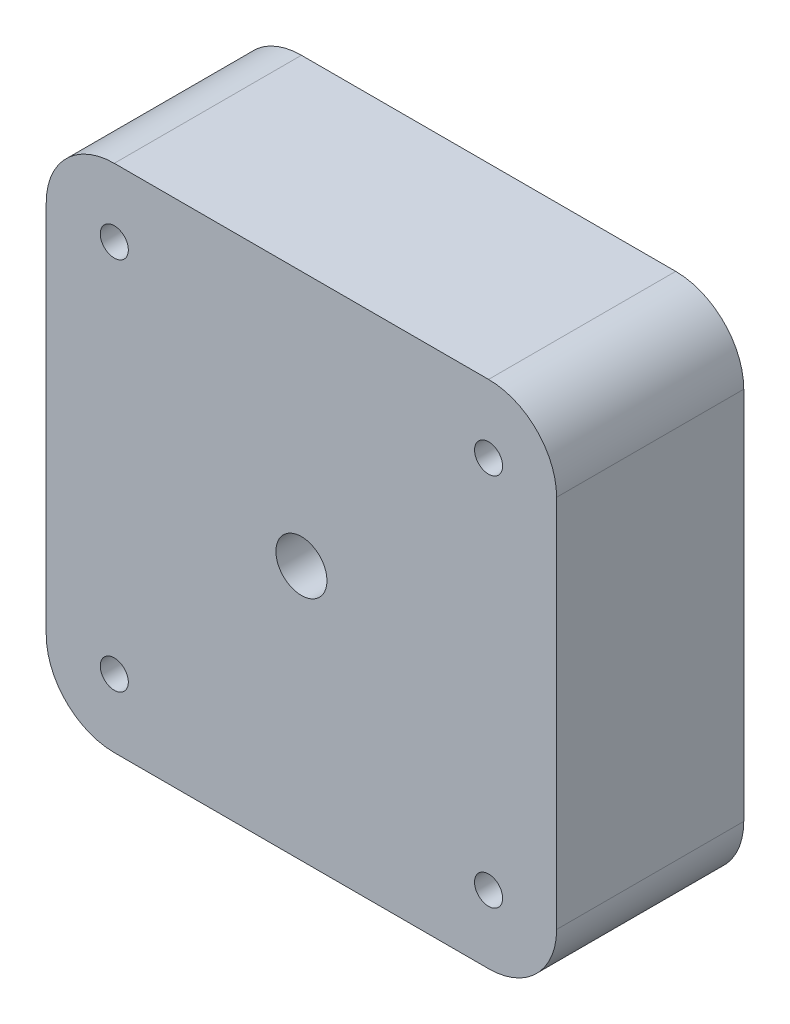
ISO-10303-21;
HEADER;
FILE_DESCRIPTION(('STEP AP214'),'2;1');
FILE_NAME('part.step','',(''),(''),'','','');
FILE_SCHEMA(('AUTOMOTIVE_DESIGN { 1 0 10303 214 1 1 1 1 }'));
ENDSEC;
DATA;
#1=APPLICATION_CONTEXT('core data for automotive mechanical design processes');
#2=APPLICATION_PROTOCOL_DEFINITION('international standard','automotive_design',2000,#1);
#3=PRODUCT_CONTEXT('',#1,'mechanical');
#4=PRODUCT('Part','Part','',(#3));
#5=PRODUCT_RELATED_PRODUCT_CATEGORY('part','',(#4));
#6=PRODUCT_DEFINITION_FORMATION('','',#4);
#7=PRODUCT_DEFINITION_CONTEXT('part definition',#1,'design');
#8=PRODUCT_DEFINITION('design','',#6,#7);
#9=PRODUCT_DEFINITION_SHAPE('','',#8);
#10=(LENGTH_UNIT() NAMED_UNIT(*) SI_UNIT(.MILLI.,.METRE.));
#11=(NAMED_UNIT(*) PLANE_ANGLE_UNIT() SI_UNIT($,.RADIAN.));
#12=(NAMED_UNIT(*) SI_UNIT($,.STERADIAN.) SOLID_ANGLE_UNIT());
#13=UNCERTAINTY_MEASURE_WITH_UNIT(LENGTH_MEASURE(1.E-05),#10,'distance_accuracy_value','');
#14=(GEOMETRIC_REPRESENTATION_CONTEXT(3) GLOBAL_UNCERTAINTY_ASSIGNED_CONTEXT((#13)) GLOBAL_UNIT_ASSIGNED_CONTEXT((#10,
#11,#12)) REPRESENTATION_CONTEXT('',''));
#15=CARTESIAN_POINT('',(0.,0.,0.));
#16=DIRECTION('',(0.,0.,1.));
#17=DIRECTION('',(1.,0.,0.));
#18=AXIS2_PLACEMENT_3D('',#15,#16,#17);
#19=CARTESIAN_POINT('',(30.,30.,22.));
#20=DIRECTION('',(-1.,0.,0.));
#21=DIRECTION('',(0.,0.,1.));
#22=AXIS2_PLACEMENT_3D('',#19,#20,#21);
#23=PLANE('',#22);
#24=DIRECTION('',(0.,1.,0.));
#25=VECTOR('',#24,1.);
#26=CARTESIAN_POINT('',(30.,30.,22.));
#27=LINE('',#26,#25);
#28=CARTESIAN_POINT('',(30.,-22.,22.));
#29=VERTEX_POINT('',#28);
#30=CARTESIAN_POINT('',(30.,22.,22.));
#31=VERTEX_POINT('',#30);
#32=EDGE_CURVE('E120',#29,#31,#27,.T.);
#33=ORIENTED_EDGE('',*,*,#32,.F.);
#34=DIRECTION('',(0.,0.,-1.));
#35=VECTOR('',#34,1.);
#36=CARTESIAN_POINT('',(30.,-22.,22.));
#37=LINE('',#36,#35);
#38=CARTESIAN_POINT('',(30.,-22.,0.));
#39=VERTEX_POINT('',#38);
#40=EDGE_CURVE('E105',#29,#39,#37,.T.);
#41=ORIENTED_EDGE('',*,*,#40,.T.);
#42=DIRECTION('',(0.,1.,0.));
#43=VECTOR('',#42,1.);
#44=CARTESIAN_POINT('',(30.,30.,0.));
#45=LINE('',#44,#43);
#46=CARTESIAN_POINT('',(30.,22.,0.));
#47=VERTEX_POINT('',#46);
#48=EDGE_CURVE('E117',#39,#47,#45,.T.);
#49=ORIENTED_EDGE('',*,*,#48,.T.);
#50=DIRECTION('',(0.,0.,-1.));
#51=VECTOR('',#50,1.);
#52=CARTESIAN_POINT('',(30.,22.,22.));
#53=LINE('',#52,#51);
#54=EDGE_CURVE('E122',#47,#31,#53,.F.);
#55=ORIENTED_EDGE('',*,*,#54,.T.);
#56=EDGE_LOOP('',(#33,#41,#49,#55));
#57=FACE_BOUND('',#56,.T.);
#58=ADVANCED_FACE('F34',(#57),#23,.F.);
#59=CARTESIAN_POINT('',(-30.,30.,22.));
#60=DIRECTION('',(0.,-1.,0.));
#61=DIRECTION('',(0.,0.,-1.));
#62=AXIS2_PLACEMENT_3D('',#59,#60,#61);
#63=PLANE('',#62);
#64=DIRECTION('',(-1.,0.,0.));
#65=VECTOR('',#64,1.);
#66=CARTESIAN_POINT('',(-30.,30.,22.));
#67=LINE('',#66,#65);
#68=CARTESIAN_POINT('',(22.,30.,22.));
#69=VERTEX_POINT('',#68);
#70=CARTESIAN_POINT('',(-22.,30.,22.));
#71=VERTEX_POINT('',#70);
#72=EDGE_CURVE('E170',#69,#71,#67,.T.);
#73=ORIENTED_EDGE('',*,*,#72,.F.);
#74=DIRECTION('',(0.,0.,-1.));
#75=VECTOR('',#74,1.);
#76=CARTESIAN_POINT('',(22.,30.,22.));
#77=LINE('',#76,#75);
#78=CARTESIAN_POINT('',(22.,30.,0.));
#79=VERTEX_POINT('',#78);
#80=EDGE_CURVE('E11',#69,#79,#77,.T.);
#81=ORIENTED_EDGE('',*,*,#80,.T.);
#82=DIRECTION('',(-1.,0.,0.));
#83=VECTOR('',#82,1.);
#84=CARTESIAN_POINT('',(-30.,30.,0.));
#85=LINE('',#84,#83);
#86=CARTESIAN_POINT('',(-22.,30.,0.));
#87=VERTEX_POINT('',#86);
#88=EDGE_CURVE('E127',#79,#87,#85,.T.);
#89=ORIENTED_EDGE('',*,*,#88,.T.);
#90=DIRECTION('',(0.,0.,-1.));
#91=VECTOR('',#90,1.);
#92=CARTESIAN_POINT('',(-22.,30.,22.));
#93=LINE('',#92,#91);
#94=EDGE_CURVE('E42',#87,#71,#93,.F.);
#95=ORIENTED_EDGE('',*,*,#94,.T.);
#96=EDGE_LOOP('',(#73,#81,#89,#95));
#97=FACE_BOUND('',#96,.T.);
#98=ADVANCED_FACE('F169',(#97),#63,.F.);
#99=CARTESIAN_POINT('',(-30.,30.,22.));
#100=DIRECTION('',(1.,0.,0.));
#101=DIRECTION('',(0.,0.,-1.));
#102=AXIS2_PLACEMENT_3D('',#99,#100,#101);
#103=PLANE('',#102);
#104=DIRECTION('',(0.,-1.,0.));
#105=VECTOR('',#104,1.);
#106=CARTESIAN_POINT('',(-30.,30.,0.));
#107=LINE('',#106,#105);
#108=CARTESIAN_POINT('',(-30.,22.,0.));
#109=VERTEX_POINT('',#108);
#110=CARTESIAN_POINT('',(-30.,-22.,0.));
#111=VERTEX_POINT('',#110);
#112=EDGE_CURVE('E131',#109,#111,#107,.T.);
#113=ORIENTED_EDGE('',*,*,#112,.T.);
#114=DIRECTION('',(0.,0.,-1.));
#115=VECTOR('',#114,1.);
#116=CARTESIAN_POINT('',(-30.,-22.,22.));
#117=LINE('',#116,#115);
#118=CARTESIAN_POINT('',(-30.,-22.,22.));
#119=VERTEX_POINT('',#118);
#120=EDGE_CURVE('E49',#111,#119,#117,.F.);
#121=ORIENTED_EDGE('',*,*,#120,.T.);
#122=DIRECTION('',(0.,-1.,0.));
#123=VECTOR('',#122,1.);
#124=CARTESIAN_POINT('',(-30.,30.,22.));
#125=LINE('',#124,#123);
#126=CARTESIAN_POINT('',(-30.,22.,22.));
#127=VERTEX_POINT('',#126);
#128=EDGE_CURVE('E176',#127,#119,#125,.T.);
#129=ORIENTED_EDGE('',*,*,#128,.F.);
#130=DIRECTION('',(0.,0.,-1.));
#131=VECTOR('',#130,1.);
#132=CARTESIAN_POINT('',(-30.,22.,22.));
#133=LINE('',#132,#131);
#134=EDGE_CURVE('E163',#127,#109,#133,.T.);
#135=ORIENTED_EDGE('',*,*,#134,.T.);
#136=EDGE_LOOP('',(#113,#121,#129,#135));
#137=FACE_BOUND('',#136,.T.);
#138=ADVANCED_FACE('F180',(#137),#103,.F.);
#139=CARTESIAN_POINT('',(-30.,-30.,22.));
#140=DIRECTION('',(0.,1.,0.));
#141=DIRECTION('',(0.,0.,1.));
#142=AXIS2_PLACEMENT_3D('',#139,#140,#141);
#143=PLANE('',#142);
#144=DIRECTION('',(1.,0.,0.));
#145=VECTOR('',#144,1.);
#146=CARTESIAN_POINT('',(-30.,-30.,0.));
#147=LINE('',#146,#145);
#148=CARTESIAN_POINT('',(-22.,-30.,0.));
#149=VERTEX_POINT('',#148);
#150=CARTESIAN_POINT('',(22.,-30.,0.));
#151=VERTEX_POINT('',#150);
#152=EDGE_CURVE('E141',#149,#151,#147,.T.);
#153=ORIENTED_EDGE('',*,*,#152,.T.);
#154=DIRECTION('',(0.,0.,-1.));
#155=VECTOR('',#154,1.);
#156=CARTESIAN_POINT('',(22.,-30.,22.));
#157=LINE('',#156,#155);
#158=CARTESIAN_POINT('',(22.,-30.,22.));
#159=VERTEX_POINT('',#158);
#160=EDGE_CURVE('E106',#151,#159,#157,.F.);
#161=ORIENTED_EDGE('',*,*,#160,.T.);
#162=DIRECTION('',(1.,0.,0.));
#163=VECTOR('',#162,1.);
#164=CARTESIAN_POINT('',(-30.,-30.,22.));
#165=LINE('',#164,#163);
#166=CARTESIAN_POINT('',(-22.,-30.,22.));
#167=VERTEX_POINT('',#166);
#168=EDGE_CURVE('E137',#167,#159,#165,.T.);
#169=ORIENTED_EDGE('',*,*,#168,.F.);
#170=DIRECTION('',(0.,0.,-1.));
#171=VECTOR('',#170,1.);
#172=CARTESIAN_POINT('',(-22.,-30.,22.));
#173=LINE('',#172,#171);
#174=EDGE_CURVE('E111',#167,#149,#173,.T.);
#175=ORIENTED_EDGE('',*,*,#174,.T.);
#176=EDGE_LOOP('',(#153,#161,#169,#175));
#177=FACE_BOUND('',#176,.T.);
#178=ADVANCED_FACE('F187',(#177),#143,.F.);
#179=CARTESIAN_POINT('',(0.,0.,22.));
#180=DIRECTION('',(0.,0.,1.));
#181=DIRECTION('',(1.,0.,0.));
#182=AXIS2_PLACEMENT_3D('',#179,#180,#181);
#183=PLANE('',#182);
#184=CARTESIAN_POINT('',(22.,22.,22.));
#185=DIRECTION('',(0.,0.,-1.));
#186=DIRECTION('',(-1.,0.,0.));
#187=AXIS2_PLACEMENT_3D('',#184,#185,#186);
#188=CIRCLE('',#187,1.65);
#189=CARTESIAN_POINT('',(20.35,22.,22.));
#190=VERTEX_POINT('',#189);
#191=EDGE_CURVE('E207',#190,#190,#188,.T.);
#192=ORIENTED_EDGE('',*,*,#191,.T.);
#193=EDGE_LOOP('',(#192));
#194=FACE_BOUND('',#193,.T.);
#195=CARTESIAN_POINT('',(-22.,22.,22.));
#196=DIRECTION('',(0.,0.,-1.));
#197=DIRECTION('',(-1.,0.,0.));
#198=AXIS2_PLACEMENT_3D('',#195,#196,#197);
#199=CIRCLE('',#198,1.65);
#200=CARTESIAN_POINT('',(-23.65,22.,22.));
#201=VERTEX_POINT('',#200);
#202=EDGE_CURVE('E201',#201,#201,#199,.T.);
#203=ORIENTED_EDGE('',*,*,#202,.T.);
#204=EDGE_LOOP('',(#203));
#205=FACE_BOUND('',#204,.T.);
#206=CARTESIAN_POINT('',(-22.,-22.,22.));
#207=DIRECTION('',(0.,0.,-1.));
#208=DIRECTION('',(-1.,0.,0.));
#209=AXIS2_PLACEMENT_3D('',#206,#207,#208);
#210=CIRCLE('',#209,1.65);
#211=CARTESIAN_POINT('',(-23.65,-22.,22.));
#212=VERTEX_POINT('',#211);
#213=EDGE_CURVE('E195',#212,#212,#210,.T.);
#214=ORIENTED_EDGE('',*,*,#213,.T.);
#215=EDGE_LOOP('',(#214));
#216=FACE_BOUND('',#215,.T.);
#217=CARTESIAN_POINT('',(22.,-22.,22.));
#218=DIRECTION('',(0.,0.,-1.));
#219=DIRECTION('',(-1.,0.,0.));
#220=AXIS2_PLACEMENT_3D('',#217,#218,#219);
#221=CIRCLE('',#220,1.65);
#222=CARTESIAN_POINT('',(20.35,-22.,22.));
#223=VERTEX_POINT('',#222);
#224=EDGE_CURVE('E134',#223,#223,#221,.T.);
#225=ORIENTED_EDGE('',*,*,#224,.T.);
#226=EDGE_LOOP('',(#225));
#227=FACE_BOUND('',#226,.T.);
#228=CARTESIAN_POINT('',(0.,0.,22.));
#229=DIRECTION('',(0.,0.,-1.));
#230=DIRECTION('',(-1.,0.,0.));
#231=AXIS2_PLACEMENT_3D('',#228,#229,#230);
#232=CIRCLE('',#231,3.);
#233=CARTESIAN_POINT('',(-3.,0.,22.));
#234=VERTEX_POINT('',#233);
#235=EDGE_CURVE('E128',#234,#234,#232,.T.);
#236=ORIENTED_EDGE('',*,*,#235,.T.);
#237=EDGE_LOOP('',(#236));
#238=FACE_BOUND('',#237,.T.);
#239=ORIENTED_EDGE('',*,*,#168,.T.);
#240=CARTESIAN_POINT('',(22.,-22.,22.));
#241=DIRECTION('',(0.,0.,1.));
#242=DIRECTION('',(1.,0.,0.));
#243=AXIS2_PLACEMENT_3D('',#240,#241,#242);
#244=CIRCLE('',#243,8.);
#245=EDGE_CURVE('E161',#159,#29,#244,.T.);
#246=ORIENTED_EDGE('',*,*,#245,.T.);
#247=ORIENTED_EDGE('',*,*,#32,.T.);
#248=CARTESIAN_POINT('',(22.,22.,22.));
#249=DIRECTION('',(0.,0.,1.));
#250=DIRECTION('',(1.,0.,0.));
#251=AXIS2_PLACEMENT_3D('',#248,#249,#250);
#252=CIRCLE('',#251,8.);
#253=EDGE_CURVE('E157',#31,#69,#252,.T.);
#254=ORIENTED_EDGE('',*,*,#253,.T.);
#255=ORIENTED_EDGE('',*,*,#72,.T.);
#256=CARTESIAN_POINT('',(-22.,22.,22.));
#257=DIRECTION('',(0.,0.,1.));
#258=DIRECTION('',(1.,0.,0.));
#259=AXIS2_PLACEMENT_3D('',#256,#257,#258);
#260=CIRCLE('',#259,8.);
#261=EDGE_CURVE('E56',#71,#127,#260,.T.);
#262=ORIENTED_EDGE('',*,*,#261,.T.);
#263=ORIENTED_EDGE('',*,*,#128,.T.);
#264=CARTESIAN_POINT('',(-22.,-22.,22.));
#265=DIRECTION('',(0.,0.,1.));
#266=DIRECTION('',(1.,0.,0.));
#267=AXIS2_PLACEMENT_3D('',#264,#265,#266);
#268=CIRCLE('',#267,8.);
#269=EDGE_CURVE('E159',#119,#167,#268,.T.);
#270=ORIENTED_EDGE('',*,*,#269,.T.);
#271=EDGE_LOOP('',(#239,#246,#247,#254,#255,#262,#263,#270));
#272=FACE_BOUND('',#271,.T.);
#273=ADVANCED_FACE('F174',(#194,#205,#216,#227,#238,#272),#183,.T.);
#274=CARTESIAN_POINT('',(0.,0.,0.));
#275=DIRECTION('',(0.,0.,1.));
#276=DIRECTION('',(1.,0.,0.));
#277=AXIS2_PLACEMENT_3D('',#274,#275,#276);
#278=PLANE('',#277);
#279=CARTESIAN_POINT('',(22.,22.,0.));
#280=DIRECTION('',(0.,0.,-1.));
#281=DIRECTION('',(-1.,0.,0.));
#282=AXIS2_PLACEMENT_3D('',#279,#280,#281);
#283=CIRCLE('',#282,1.64999999999999);
#284=CARTESIAN_POINT('',(20.35,22.,0.));
#285=VERTEX_POINT('',#284);
#286=EDGE_CURVE('E210',#285,#285,#283,.T.);
#287=ORIENTED_EDGE('',*,*,#286,.F.);
#288=EDGE_LOOP('',(#287));
#289=FACE_BOUND('',#288,.T.);
#290=CARTESIAN_POINT('',(-22.,22.,0.));
#291=DIRECTION('',(0.,0.,-1.));
#292=DIRECTION('',(-1.,0.,0.));
#293=AXIS2_PLACEMENT_3D('',#290,#291,#292);
#294=CIRCLE('',#293,1.64999999999999);
#295=CARTESIAN_POINT('',(-23.65,22.,0.));
#296=VERTEX_POINT('',#295);
#297=EDGE_CURVE('E204',#296,#296,#294,.T.);
#298=ORIENTED_EDGE('',*,*,#297,.F.);
#299=EDGE_LOOP('',(#298));
#300=FACE_BOUND('',#299,.T.);
#301=CARTESIAN_POINT('',(-22.,-22.,0.));
#302=DIRECTION('',(0.,0.,-1.));
#303=DIRECTION('',(-1.,0.,0.));
#304=AXIS2_PLACEMENT_3D('',#301,#302,#303);
#305=CIRCLE('',#304,1.64999999999999);
#306=CARTESIAN_POINT('',(-23.65,-22.,0.));
#307=VERTEX_POINT('',#306);
#308=EDGE_CURVE('E198',#307,#307,#305,.T.);
#309=ORIENTED_EDGE('',*,*,#308,.F.);
#310=EDGE_LOOP('',(#309));
#311=FACE_BOUND('',#310,.T.);
#312=CARTESIAN_POINT('',(22.,-22.,0.));
#313=DIRECTION('',(0.,0.,-1.));
#314=DIRECTION('',(-1.,0.,0.));
#315=AXIS2_PLACEMENT_3D('',#312,#313,#314);
#316=CIRCLE('',#315,1.64999999999999);
#317=CARTESIAN_POINT('',(20.35,-22.,0.));
#318=VERTEX_POINT('',#317);
#319=EDGE_CURVE('E192',#318,#318,#316,.T.);
#320=ORIENTED_EDGE('',*,*,#319,.F.);
#321=EDGE_LOOP('',(#320));
#322=FACE_BOUND('',#321,.T.);
#323=CARTESIAN_POINT('',(0.,0.,0.));
#324=DIRECTION('',(0.,0.,1.));
#325=DIRECTION('',(1.,0.,0.));
#326=AXIS2_PLACEMENT_3D('',#323,#324,#325);
#327=CIRCLE('',#326,6.);
#328=CARTESIAN_POINT('',(6.,0.,0.));
#329=VERTEX_POINT('',#328);
#330=EDGE_CURVE('E146',#329,#329,#327,.T.);
#331=ORIENTED_EDGE('',*,*,#330,.T.);
#332=EDGE_LOOP('',(#331));
#333=FACE_BOUND('',#332,.T.);
#334=ORIENTED_EDGE('',*,*,#48,.F.);
#335=CARTESIAN_POINT('',(22.,-22.,0.));
#336=DIRECTION('',(0.,0.,1.));
#337=DIRECTION('',(1.,0.,0.));
#338=AXIS2_PLACEMENT_3D('',#335,#336,#337);
#339=CIRCLE('',#338,8.);
#340=EDGE_CURVE('E101',#39,#151,#339,.F.);
#341=ORIENTED_EDGE('',*,*,#340,.T.);
#342=ORIENTED_EDGE('',*,*,#152,.F.);
#343=CARTESIAN_POINT('',(-22.,-22.,0.));
#344=DIRECTION('',(0.,0.,1.));
#345=DIRECTION('',(1.,0.,0.));
#346=AXIS2_PLACEMENT_3D('',#343,#344,#345);
#347=CIRCLE('',#346,8.);
#348=EDGE_CURVE('E112',#149,#111,#347,.F.);
#349=ORIENTED_EDGE('',*,*,#348,.T.);
#350=ORIENTED_EDGE('',*,*,#112,.F.);
#351=CARTESIAN_POINT('',(-22.,22.,0.));
#352=DIRECTION('',(0.,0.,1.));
#353=DIRECTION('',(1.,0.,0.));
#354=AXIS2_PLACEMENT_3D('',#351,#352,#353);
#355=CIRCLE('',#354,8.);
#356=EDGE_CURVE('E121',#109,#87,#355,.F.);
#357=ORIENTED_EDGE('',*,*,#356,.T.);
#358=ORIENTED_EDGE('',*,*,#88,.F.);
#359=CARTESIAN_POINT('',(22.,22.,0.));
#360=DIRECTION('',(0.,0.,1.));
#361=DIRECTION('',(1.,0.,0.));
#362=AXIS2_PLACEMENT_3D('',#359,#360,#361);
#363=CIRCLE('',#362,8.);
#364=EDGE_CURVE('E126',#79,#47,#363,.F.);
#365=ORIENTED_EDGE('',*,*,#364,.T.);
#366=EDGE_LOOP('',(#334,#341,#342,#349,#350,#357,#358,#365));
#367=FACE_BOUND('',#366,.T.);
#368=ADVANCED_FACE('F124',(#289,#300,#311,#322,#333,#367),#278,.F.);
#369=CARTESIAN_POINT('',(0.,0.,22.));
#370=DIRECTION('',(0.,0.,-1.));
#371=DIRECTION('',(-1.,0.,0.));
#372=AXIS2_PLACEMENT_3D('',#369,#370,#371);
#373=CYLINDRICAL_SURFACE('',#372,3.);
#374=CARTESIAN_POINT('',(0.,0.,2.99999999999998));
#375=DIRECTION('',(0.,0.,1.));
#376=DIRECTION('',(1.,0.,0.));
#377=AXIS2_PLACEMENT_3D('',#374,#375,#376);
#378=CIRCLE('',#377,3.);
#379=CARTESIAN_POINT('',(3.,0.,2.99999999999998));
#380=VERTEX_POINT('',#379);
#381=EDGE_CURVE('E143',#380,#380,#378,.F.);
#382=ORIENTED_EDGE('',*,*,#381,.T.);
#383=EDGE_LOOP('',(#382));
#384=FACE_BOUND('',#383,.T.);
#385=ORIENTED_EDGE('',*,*,#235,.F.);
#386=EDGE_LOOP('',(#385));
#387=FACE_BOUND('',#386,.T.);
#388=ADVANCED_FACE('F218',(#384,#387),#373,.F.);
#389=CARTESIAN_POINT('',(0.,0.,2.99999999999998));
#390=DIRECTION('',(0.,0.,-1.));
#391=DIRECTION('',(-1.,0.,0.));
#392=AXIS2_PLACEMENT_3D('',#389,#390,#391);
#393=CONICAL_SURFACE('',#392,3.,0.785398163397451);
#394=ORIENTED_EDGE('',*,*,#330,.F.);
#395=EDGE_LOOP('',(#394));
#396=FACE_BOUND('',#395,.T.);
#397=ORIENTED_EDGE('',*,*,#381,.F.);
#398=EDGE_LOOP('',(#397));
#399=FACE_BOUND('',#398,.T.);
#400=ADVANCED_FACE('F228',(#396,#399),#393,.F.);
#401=CARTESIAN_POINT('',(22.,-22.,22.));
#402=DIRECTION('',(0.,0.,-1.));
#403=DIRECTION('',(-1.,0.,0.));
#404=AXIS2_PLACEMENT_3D('',#401,#402,#403);
#405=CYLINDRICAL_SURFACE('',#404,8.);
#406=ORIENTED_EDGE('',*,*,#245,.F.);
#407=ORIENTED_EDGE('',*,*,#160,.F.);
#408=ORIENTED_EDGE('',*,*,#340,.F.);
#409=ORIENTED_EDGE('',*,*,#40,.F.);
#410=EDGE_LOOP('',(#406,#407,#408,#409));
#411=FACE_BOUND('',#410,.T.);
#412=ADVANCED_FACE('F104',(#411),#405,.T.);
#413=CARTESIAN_POINT('',(-22.,-22.,22.));
#414=DIRECTION('',(0.,0.,-1.));
#415=DIRECTION('',(-1.,0.,0.));
#416=AXIS2_PLACEMENT_3D('',#413,#414,#415);
#417=CYLINDRICAL_SURFACE('',#416,8.);
#418=ORIENTED_EDGE('',*,*,#269,.F.);
#419=ORIENTED_EDGE('',*,*,#120,.F.);
#420=ORIENTED_EDGE('',*,*,#348,.F.);
#421=ORIENTED_EDGE('',*,*,#174,.F.);
#422=EDGE_LOOP('',(#418,#419,#420,#421));
#423=FACE_BOUND('',#422,.T.);
#424=ADVANCED_FACE('F184',(#423),#417,.T.);
#425=CARTESIAN_POINT('',(22.,22.,22.));
#426=DIRECTION('',(0.,0.,-1.));
#427=DIRECTION('',(-1.,0.,0.));
#428=AXIS2_PLACEMENT_3D('',#425,#426,#427);
#429=CYLINDRICAL_SURFACE('',#428,8.);
#430=ORIENTED_EDGE('',*,*,#253,.F.);
#431=ORIENTED_EDGE('',*,*,#54,.F.);
#432=ORIENTED_EDGE('',*,*,#364,.F.);
#433=ORIENTED_EDGE('',*,*,#80,.F.);
#434=EDGE_LOOP('',(#430,#431,#432,#433));
#435=FACE_BOUND('',#434,.T.);
#436=ADVANCED_FACE('F258',(#435),#429,.T.);
#437=CARTESIAN_POINT('',(-22.,22.,22.));
#438=DIRECTION('',(0.,0.,-1.));
#439=DIRECTION('',(-1.,0.,0.));
#440=AXIS2_PLACEMENT_3D('',#437,#438,#439);
#441=CYLINDRICAL_SURFACE('',#440,8.);
#442=ORIENTED_EDGE('',*,*,#261,.F.);
#443=ORIENTED_EDGE('',*,*,#94,.F.);
#444=ORIENTED_EDGE('',*,*,#356,.F.);
#445=ORIENTED_EDGE('',*,*,#134,.F.);
#446=EDGE_LOOP('',(#442,#443,#444,#445));
#447=FACE_BOUND('',#446,.T.);
#448=ADVANCED_FACE('F36',(#447),#441,.T.);
#449=CARTESIAN_POINT('',(22.,-22.,0.));
#450=DIRECTION('',(0.,0.,-1.));
#451=DIRECTION('',(-1.,0.,0.));
#452=AXIS2_PLACEMENT_3D('',#449,#450,#451);
#453=CYLINDRICAL_SURFACE('',#452,1.64999999999999);
#454=ORIENTED_EDGE('',*,*,#224,.F.);
#455=EDGE_LOOP('',(#454));
#456=FACE_BOUND('',#455,.T.);
#457=ORIENTED_EDGE('',*,*,#319,.T.);
#458=EDGE_LOOP('',(#457));
#459=FACE_BOUND('',#458,.T.);
#460=ADVANCED_FACE('F264',(#456,#459),#453,.F.);
#461=CARTESIAN_POINT('',(-22.,-22.,0.));
#462=DIRECTION('',(0.,0.,-1.));
#463=DIRECTION('',(-1.,0.,0.));
#464=AXIS2_PLACEMENT_3D('',#461,#462,#463);
#465=CYLINDRICAL_SURFACE('',#464,1.64999999999999);
#466=ORIENTED_EDGE('',*,*,#213,.F.);
#467=EDGE_LOOP('',(#466));
#468=FACE_BOUND('',#467,.T.);
#469=ORIENTED_EDGE('',*,*,#308,.T.);
#470=EDGE_LOOP('',(#469));
#471=FACE_BOUND('',#470,.T.);
#472=ADVANCED_FACE('F268',(#468,#471),#465,.F.);
#473=CARTESIAN_POINT('',(-22.,22.,0.));
#474=DIRECTION('',(0.,0.,-1.));
#475=DIRECTION('',(-1.,0.,0.));
#476=AXIS2_PLACEMENT_3D('',#473,#474,#475);
#477=CYLINDRICAL_SURFACE('',#476,1.64999999999999);
#478=ORIENTED_EDGE('',*,*,#202,.F.);
#479=EDGE_LOOP('',(#478));
#480=FACE_BOUND('',#479,.T.);
#481=ORIENTED_EDGE('',*,*,#297,.T.);
#482=EDGE_LOOP('',(#481));
#483=FACE_BOUND('',#482,.T.);
#484=ADVANCED_FACE('F274',(#480,#483),#477,.F.);
#485=CARTESIAN_POINT('',(22.,22.,0.));
#486=DIRECTION('',(0.,0.,-1.));
#487=DIRECTION('',(-1.,0.,0.));
#488=AXIS2_PLACEMENT_3D('',#485,#486,#487);
#489=CYLINDRICAL_SURFACE('',#488,1.64999999999999);
#490=ORIENTED_EDGE('',*,*,#191,.F.);
#491=EDGE_LOOP('',(#490));
#492=FACE_BOUND('',#491,.T.);
#493=ORIENTED_EDGE('',*,*,#286,.T.);
#494=EDGE_LOOP('',(#493));
#495=FACE_BOUND('',#494,.T.);
#496=ADVANCED_FACE('F214',(#492,#495),#489,.F.);
#497=CLOSED_SHELL('',(#58,#98,#138,#178,#273,#368,#388,#400,#412,#424,#436,#448,#460,#472,#484,#496));
#498=MANIFOLD_SOLID_BREP('B2',#497);
#499=ADVANCED_BREP_SHAPE_REPRESENTATION('',(#18,#498),#14);
#500=SHAPE_DEFINITION_REPRESENTATION(#9,#499);
ENDSEC;
END-ISO-10303-21;
